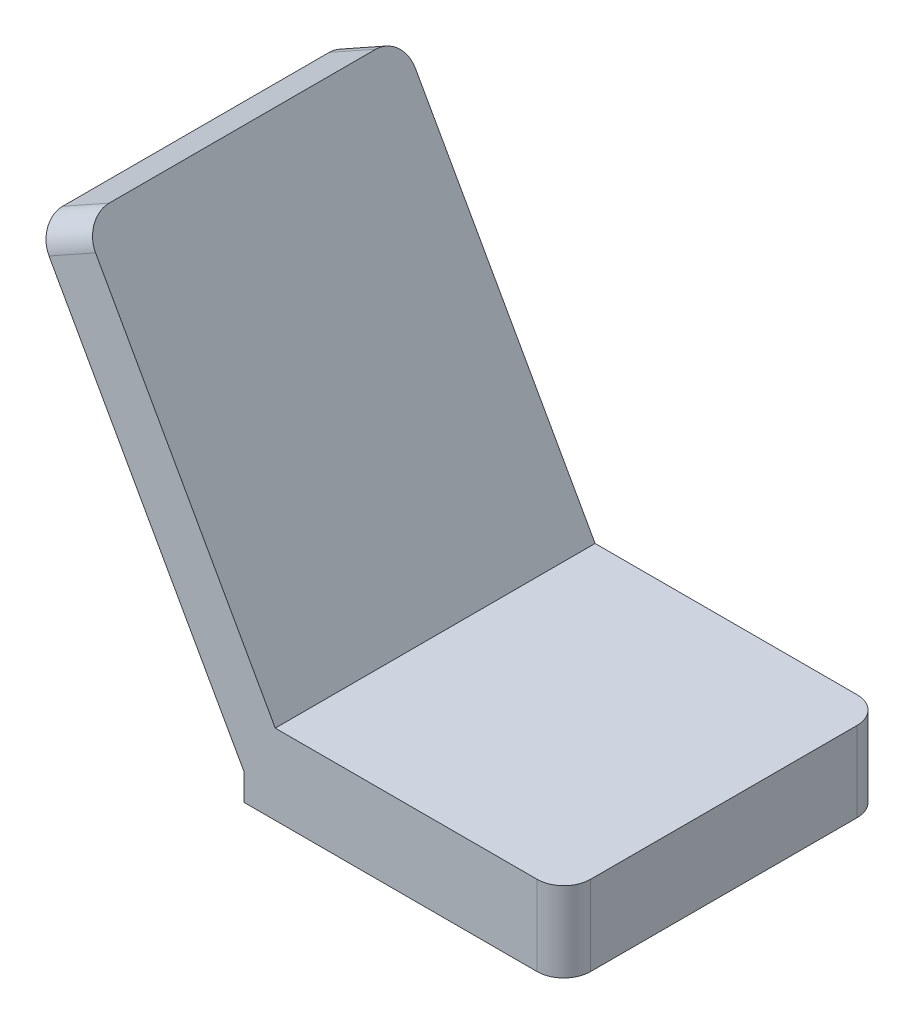
ISO-10303-21;
HEADER;
FILE_DESCRIPTION(('STEP AP214'),'2;1');
FILE_NAME('part.step','',(''),(''),'','','');
FILE_SCHEMA(('AUTOMOTIVE_DESIGN { 1 0 10303 214 1 1 1 1 }'));
ENDSEC;
DATA;
#1=APPLICATION_CONTEXT('core data for automotive mechanical design processes');
#2=APPLICATION_PROTOCOL_DEFINITION('international standard','automotive_design',2000,#1);
#3=PRODUCT_CONTEXT('',#1,'mechanical');
#4=PRODUCT('Part','Part','',(#3));
#5=PRODUCT_RELATED_PRODUCT_CATEGORY('part','',(#4));
#6=PRODUCT_DEFINITION_FORMATION('','',#4);
#7=PRODUCT_DEFINITION_CONTEXT('part definition',#1,'design');
#8=PRODUCT_DEFINITION('design','',#6,#7);
#9=PRODUCT_DEFINITION_SHAPE('','',#8);
#10=(LENGTH_UNIT() NAMED_UNIT(*) SI_UNIT(.MILLI.,.METRE.));
#11=(NAMED_UNIT(*) PLANE_ANGLE_UNIT() SI_UNIT($,.RADIAN.));
#12=(NAMED_UNIT(*) SI_UNIT($,.STERADIAN.) SOLID_ANGLE_UNIT());
#13=UNCERTAINTY_MEASURE_WITH_UNIT(LENGTH_MEASURE(1.E-05),#10,'distance_accuracy_value','');
#14=(GEOMETRIC_REPRESENTATION_CONTEXT(3) GLOBAL_UNCERTAINTY_ASSIGNED_CONTEXT((#13)) GLOBAL_UNIT_ASSIGNED_CONTEXT((#10,
#11,#12)) REPRESENTATION_CONTEXT('',''));
#15=CARTESIAN_POINT('',(0.,0.,0.));
#16=DIRECTION('',(0.,0.,1.));
#17=DIRECTION('',(1.,0.,0.));
#18=AXIS2_PLACEMENT_3D('',#15,#16,#17);
#19=CARTESIAN_POINT('',(-42.5966551147028,76.2512643083801,5.));
#20=DIRECTION('',(0.873013415052539,0.487696193483509,0.));
#21=DIRECTION('',(-0.487696193483509,0.873013415052539,0.));
#22=AXIS2_PLACEMENT_3D('',#19,#20,#21);
#23=CYLINDRICAL_SURFACE('',#22,5.);
#24=DIRECTION('',(0.873013415052539,0.487696193483509,0.));
#25=VECTOR('',#24,1.);
#26=CARTESIAN_POINT('',(-42.5966551147028,76.2512643083801,0.));
#27=LINE('',#26,#25);
#28=CARTESIAN_POINT('',(-61.885189794692,65.4760061289404,0.));
#29=VERTEX_POINT('',#28);
#30=CARTESIAN_POINT('',(-53.1550556441666,70.3529680637755,0.));
#31=VERTEX_POINT('',#30);
#32=EDGE_CURVE('E238',#29,#31,#27,.T.);
#33=ORIENTED_EDGE('',*,*,#32,.F.);
#34=CARTESIAN_POINT('',(-61.885189794692,65.4760061289404,5.));
#35=DIRECTION('',(-0.873013415052539,-0.487696193483508,0.));
#36=DIRECTION('',(0.487696193483508,-0.873013415052539,0.));
#37=AXIS2_PLACEMENT_3D('',#34,#35,#36);
#38=CIRCLE('',#37,5.);
#39=CARTESIAN_POINT('',(-64.3236707621096,69.8410732042031,5.));
#40=VERTEX_POINT('',#39);
#41=EDGE_CURVE('E53',#40,#29,#38,.T.);
#42=ORIENTED_EDGE('',*,*,#41,.F.);
#43=DIRECTION('',(0.873013415052539,0.487696193483509,0.));
#44=VECTOR('',#43,1.);
#45=CARTESIAN_POINT('',(-64.3236707621096,69.8410732042031,5.));
#46=LINE('',#45,#44);
#47=CARTESIAN_POINT('',(-55.5935366115842,74.7180351390382,5.));
#48=VERTEX_POINT('',#47);
#49=EDGE_CURVE('E242',#48,#40,#46,.F.);
#50=ORIENTED_EDGE('',*,*,#49,.F.);
#51=CARTESIAN_POINT('',(-53.1550556441666,70.3529680637755,5.));
#52=DIRECTION('',(-0.873013415052539,-0.487696193483508,0.));
#53=DIRECTION('',(0.487696193483508,-0.873013415052539,0.));
#54=AXIS2_PLACEMENT_3D('',#51,#52,#53);
#55=CIRCLE('',#54,5.);
#56=EDGE_CURVE('E11',#31,#48,#55,.F.);
#57=ORIENTED_EDGE('',*,*,#56,.F.);
#58=EDGE_LOOP('',(#33,#42,#50,#57));
#59=FACE_BOUND('',#58,.T.);
#60=ADVANCED_FACE('F45',(#59),#23,.T.);
#61=CARTESIAN_POINT('',(29.6920247165711,10.,5.));
#62=DIRECTION('',(0.,1.,0.));
#63=DIRECTION('',(0.,0.,1.));
#64=AXIS2_PLACEMENT_3D('',#61,#62,#63);
#65=CYLINDRICAL_SURFACE('',#64,5.);
#66=DIRECTION('',(0.,1.,0.));
#67=VECTOR('',#66,1.);
#68=CARTESIAN_POINT('',(34.6920247165711,10.,5.));
#69=LINE('',#68,#67);
#70=CARTESIAN_POINT('',(34.6920247165711,-5.,5.));
#71=VERTEX_POINT('',#70);
#72=CARTESIAN_POINT('',(34.6920247165711,10.,5.));
#73=VERTEX_POINT('',#72);
#74=EDGE_CURVE('E226',#71,#73,#69,.T.);
#75=ORIENTED_EDGE('',*,*,#74,.F.);
#76=CARTESIAN_POINT('',(29.6920247165711,-5.,5.));
#77=DIRECTION('',(0.,-1.,0.));
#78=DIRECTION('',(1.,0.,0.));
#79=AXIS2_PLACEMENT_3D('',#76,#77,#78);
#80=CIRCLE('',#79,5.);
#81=CARTESIAN_POINT('',(29.6920247165711,-5.,0.));
#82=VERTEX_POINT('',#81);
#83=EDGE_CURVE('E232',#82,#71,#80,.T.);
#84=ORIENTED_EDGE('',*,*,#83,.F.);
#85=DIRECTION('',(0.,1.,0.));
#86=VECTOR('',#85,1.);
#87=CARTESIAN_POINT('',(29.6920247165711,0.,0.));
#88=LINE('',#87,#86);
#89=CARTESIAN_POINT('',(29.6920247165711,10.,0.));
#90=VERTEX_POINT('',#89);
#91=EDGE_CURVE('E136',#90,#82,#88,.F.);
#92=ORIENTED_EDGE('',*,*,#91,.F.);
#93=CARTESIAN_POINT('',(29.6920247165711,10.,5.));
#94=DIRECTION('',(0.,-1.,0.));
#95=DIRECTION('',(1.,0.,0.));
#96=AXIS2_PLACEMENT_3D('',#93,#94,#95);
#97=CIRCLE('',#96,5.);
#98=EDGE_CURVE('E235',#73,#90,#97,.F.);
#99=ORIENTED_EDGE('',*,*,#98,.F.);
#100=EDGE_LOOP('',(#75,#84,#92,#99));
#101=FACE_BOUND('',#100,.T.);
#102=ADVANCED_FACE('F258',(#101),#65,.T.);
#103=CARTESIAN_POINT('',(29.6920247165711,0.,55.));
#104=DIRECTION('',(0.,-1.,0.));
#105=DIRECTION('',(0.,0.,-1.));
#106=AXIS2_PLACEMENT_3D('',#103,#104,#105);
#107=CYLINDRICAL_SURFACE('',#106,5.);
#108=DIRECTION('',(0.,1.,0.));
#109=VECTOR('',#108,1.);
#110=CARTESIAN_POINT('',(29.6920247165711,0.,60.));
#111=LINE('',#110,#109);
#112=CARTESIAN_POINT('',(29.6920247165711,-5.,60.));
#113=VERTEX_POINT('',#112);
#114=CARTESIAN_POINT('',(29.6920247165711,10.,60.));
#115=VERTEX_POINT('',#114);
#116=EDGE_CURVE('E212',#113,#115,#111,.T.);
#117=ORIENTED_EDGE('',*,*,#116,.F.);
#118=CARTESIAN_POINT('',(29.6920247165711,-5.,55.));
#119=DIRECTION('',(0.,-1.,0.));
#120=DIRECTION('',(1.,0.,0.));
#121=AXIS2_PLACEMENT_3D('',#118,#119,#120);
#122=CIRCLE('',#121,5.);
#123=CARTESIAN_POINT('',(34.6920247165711,-5.,55.));
#124=VERTEX_POINT('',#123);
#125=EDGE_CURVE('E220',#124,#113,#122,.T.);
#126=ORIENTED_EDGE('',*,*,#125,.F.);
#127=DIRECTION('',(0.,1.,0.));
#128=VECTOR('',#127,1.);
#129=CARTESIAN_POINT('',(34.6920247165711,0.,55.));
#130=LINE('',#129,#128);
#131=CARTESIAN_POINT('',(34.6920247165711,10.,55.));
#132=VERTEX_POINT('',#131);
#133=EDGE_CURVE('E216',#132,#124,#130,.F.);
#134=ORIENTED_EDGE('',*,*,#133,.F.);
#135=CARTESIAN_POINT('',(29.6920247165711,10.,55.));
#136=DIRECTION('',(0.,-1.,0.));
#137=DIRECTION('',(1.,0.,0.));
#138=AXIS2_PLACEMENT_3D('',#135,#136,#137);
#139=CIRCLE('',#138,5.);
#140=EDGE_CURVE('E223',#115,#132,#139,.F.);
#141=ORIENTED_EDGE('',*,*,#140,.F.);
#142=EDGE_LOOP('',(#117,#126,#134,#141));
#143=FACE_BOUND('',#142,.T.);
#144=ADVANCED_FACE('F267',(#143),#107,.T.);
#145=CARTESIAN_POINT('',(-42.5966551147028,76.2512643083801,55.));
#146=DIRECTION('',(0.873013415052539,0.487696193483509,0.));
#147=DIRECTION('',(-0.487696193483509,0.873013415052539,0.));
#148=AXIS2_PLACEMENT_3D('',#145,#146,#147);
#149=CYLINDRICAL_SURFACE('',#148,5.);
#150=DIRECTION('',(-0.873013415052539,-0.487696193483509,0.));
#151=VECTOR('',#150,1.);
#152=CARTESIAN_POINT('',(-42.5966551147028,76.2512643083801,60.));
#153=LINE('',#152,#151);
#154=CARTESIAN_POINT('',(-53.1550556441666,70.3529680637755,60.));
#155=VERTEX_POINT('',#154);
#156=CARTESIAN_POINT('',(-61.885189794692,65.4760061289404,60.));
#157=VERTEX_POINT('',#156);
#158=EDGE_CURVE('E198',#155,#157,#153,.T.);
#159=ORIENTED_EDGE('',*,*,#158,.F.);
#160=CARTESIAN_POINT('',(-53.1550556441666,70.3529680637755,55.));
#161=DIRECTION('',(-0.873013415052539,-0.487696193483508,0.));
#162=DIRECTION('',(0.487696193483508,-0.873013415052539,0.));
#163=AXIS2_PLACEMENT_3D('',#160,#161,#162);
#164=CIRCLE('',#163,5.);
#165=CARTESIAN_POINT('',(-55.5935366115842,74.7180351390382,55.));
#166=VERTEX_POINT('',#165);
#167=EDGE_CURVE('E206',#166,#155,#164,.F.);
#168=ORIENTED_EDGE('',*,*,#167,.F.);
#169=DIRECTION('',(-0.873013415052539,-0.487696193483509,0.));
#170=VECTOR('',#169,1.);
#171=CARTESIAN_POINT('',(-45.0351360821203,80.6163313836428,55.));
#172=LINE('',#171,#170);
#173=CARTESIAN_POINT('',(-64.3236707621096,69.8410732042031,55.));
#174=VERTEX_POINT('',#173);
#175=EDGE_CURVE('E202',#174,#166,#172,.F.);
#176=ORIENTED_EDGE('',*,*,#175,.F.);
#177=CARTESIAN_POINT('',(-61.885189794692,65.4760061289404,55.));
#178=DIRECTION('',(-0.873013415052539,-0.487696193483508,0.));
#179=DIRECTION('',(0.487696193483508,-0.873013415052539,0.));
#180=AXIS2_PLACEMENT_3D('',#177,#178,#179);
#181=CIRCLE('',#180,5.);
#182=EDGE_CURVE('E209',#157,#174,#181,.T.);
#183=ORIENTED_EDGE('',*,*,#182,.F.);
#184=EDGE_LOOP('',(#159,#168,#176,#183));
#185=FACE_BOUND('',#184,.T.);
#186=ADVANCED_FACE('F286',(#185),#149,.T.);
#187=CARTESIAN_POINT('',(-16.5778411329035,4.87696193483508,60.));
#188=DIRECTION('',(-0.873013415052539,-0.487696193483508,0.));
#189=DIRECTION('',(0.487696193483508,-0.873013415052539,0.));
#190=AXIS2_PLACEMENT_3D('',#187,#188,#189);
#191=PLANE('',#190);
#192=DIRECTION('',(-0.487696193483508,0.873013415052539,0.));
#193=VECTOR('',#192,1.);
#194=CARTESIAN_POINT('',(-16.5778411329035,4.87696193483508,0.));
#195=LINE('',#194,#193);
#196=CARTESIAN_POINT('',(-19.4397515232515,10.,0.));
#197=VERTEX_POINT('',#196);
#198=EDGE_CURVE('E154',#197,#31,#195,.T.);
#199=ORIENTED_EDGE('',*,*,#198,.T.);
#200=ORIENTED_EDGE('',*,*,#56,.T.);
#201=DIRECTION('',(0.,0.,-1.));
#202=VECTOR('',#201,1.);
#203=CARTESIAN_POINT('',(-55.5935366115842,74.7180351390382,60.));
#204=LINE('',#203,#202);
#205=EDGE_CURVE('E194',#166,#48,#204,.T.);
#206=ORIENTED_EDGE('',*,*,#205,.F.);
#207=ORIENTED_EDGE('',*,*,#167,.T.);
#208=DIRECTION('',(-0.487696193483508,0.873013415052539,0.));
#209=VECTOR('',#208,1.);
#210=CARTESIAN_POINT('',(-16.5778411329035,4.87696193483508,60.));
#211=LINE('',#210,#209);
#212=CARTESIAN_POINT('',(-19.4397515232515,10.,60.));
#213=VERTEX_POINT('',#212);
#214=EDGE_CURVE('E164',#213,#155,#211,.T.);
#215=ORIENTED_EDGE('',*,*,#214,.F.);
#216=DIRECTION('',(0.,0.,-1.));
#217=VECTOR('',#216,1.);
#218=CARTESIAN_POINT('',(-19.4397515232515,10.,60.));
#219=LINE('',#218,#217);
#220=EDGE_CURVE('E175',#213,#197,#219,.T.);
#221=ORIENTED_EDGE('',*,*,#220,.T.);
#222=EDGE_LOOP('',(#199,#200,#206,#207,#215,#221));
#223=FACE_BOUND('',#222,.T.);
#224=ADVANCED_FACE('F249',(#223),#191,.F.);
#225=CARTESIAN_POINT('',(-64.3236707621096,69.8410732042031,60.));
#226=DIRECTION('',(-0.487696193483509,0.873013415052539,0.));
#227=DIRECTION('',(-0.873013415052539,-0.487696193483509,0.));
#228=AXIS2_PLACEMENT_3D('',#225,#226,#227);
#229=PLANE('',#228);
#230=ORIENTED_EDGE('',*,*,#205,.T.);
#231=ORIENTED_EDGE('',*,*,#49,.T.);
#232=DIRECTION('',(0.,0.,-1.));
#233=VECTOR('',#232,1.);
#234=CARTESIAN_POINT('',(-64.3236707621096,69.8410732042031,60.));
#235=LINE('',#234,#233);
#236=EDGE_CURVE('E190',#174,#40,#235,.T.);
#237=ORIENTED_EDGE('',*,*,#236,.F.);
#238=ORIENTED_EDGE('',*,*,#175,.T.);
#239=EDGE_LOOP('',(#230,#231,#237,#238));
#240=FACE_BOUND('',#239,.T.);
#241=ADVANCED_FACE('F277',(#240),#229,.T.);
#242=CARTESIAN_POINT('',(-25.3079752834289,0.,60.));
#243=DIRECTION('',(-0.873013415052539,-0.487696193483508,0.));
#244=DIRECTION('',(0.487696193483508,-0.873013415052539,0.));
#245=AXIS2_PLACEMENT_3D('',#242,#243,#244);
#246=PLANE('',#245);
#247=ORIENTED_EDGE('',*,*,#236,.T.);
#248=ORIENTED_EDGE('',*,*,#41,.T.);
#249=DIRECTION('',(-0.487696193483508,0.873013415052539,0.));
#250=VECTOR('',#249,1.);
#251=CARTESIAN_POINT('',(-25.3079752834289,0.,0.));
#252=LINE('',#251,#250);
#253=CARTESIAN_POINT('',(-25.3079752834289,0.,0.));
#254=VERTEX_POINT('',#253);
#255=EDGE_CURVE('E159',#254,#29,#252,.T.);
#256=ORIENTED_EDGE('',*,*,#255,.F.);
#257=DIRECTION('',(0.,0.,-1.));
#258=VECTOR('',#257,1.);
#259=CARTESIAN_POINT('',(-25.3079752834289,0.,60.));
#260=LINE('',#259,#258);
#261=CARTESIAN_POINT('',(-25.3079752834289,0.,60.));
#262=VERTEX_POINT('',#261);
#263=EDGE_CURVE('E152',#262,#254,#260,.T.);
#264=ORIENTED_EDGE('',*,*,#263,.F.);
#265=DIRECTION('',(-0.487696193483508,0.873013415052539,0.));
#266=VECTOR('',#265,1.);
#267=CARTESIAN_POINT('',(-25.3079752834289,0.,60.));
#268=LINE('',#267,#266);
#269=EDGE_CURVE('E168',#262,#157,#268,.T.);
#270=ORIENTED_EDGE('',*,*,#269,.T.);
#271=ORIENTED_EDGE('',*,*,#182,.T.);
#272=EDGE_LOOP('',(#247,#248,#256,#264,#270,#271));
#273=FACE_BOUND('',#272,.T.);
#274=ADVANCED_FACE('F246',(#273),#246,.T.);
#275=CARTESIAN_POINT('',(34.6920247165711,10.,60.));
#276=DIRECTION('',(1.,0.,0.));
#277=DIRECTION('',(0.,0.,-1.));
#278=AXIS2_PLACEMENT_3D('',#275,#276,#277);
#279=PLANE('',#278);
#280=DIRECTION('',(0.,0.,1.));
#281=VECTOR('',#280,1.);
#282=CARTESIAN_POINT('',(34.6920247165711,-5.,60.));
#283=LINE('',#282,#281);
#284=EDGE_CURVE('E139',#71,#124,#283,.T.);
#285=ORIENTED_EDGE('',*,*,#284,.F.);
#286=ORIENTED_EDGE('',*,*,#74,.T.);
#287=DIRECTION('',(0.,0.,-1.));
#288=VECTOR('',#287,1.);
#289=CARTESIAN_POINT('',(34.6920247165711,10.,60.));
#290=LINE('',#289,#288);
#291=EDGE_CURVE('E184',#132,#73,#290,.T.);
#292=ORIENTED_EDGE('',*,*,#291,.F.);
#293=ORIENTED_EDGE('',*,*,#133,.T.);
#294=EDGE_LOOP('',(#285,#286,#292,#293));
#295=FACE_BOUND('',#294,.T.);
#296=ADVANCED_FACE('F268',(#295),#279,.T.);
#297=CARTESIAN_POINT('',(34.6920247165711,10.,60.));
#298=DIRECTION('',(0.,-1.,0.));
#299=DIRECTION('',(1.,0.,0.));
#300=AXIS2_PLACEMENT_3D('',#297,#298,#299);
#301=PLANE('',#300);
#302=ORIENTED_EDGE('',*,*,#291,.T.);
#303=ORIENTED_EDGE('',*,*,#98,.T.);
#304=DIRECTION('',(-1.,0.,0.));
#305=VECTOR('',#304,1.);
#306=CARTESIAN_POINT('',(34.6920247165711,10.,0.));
#307=LINE('',#306,#305);
#308=EDGE_CURVE('E169',#90,#197,#307,.T.);
#309=ORIENTED_EDGE('',*,*,#308,.T.);
#310=ORIENTED_EDGE('',*,*,#220,.F.);
#311=DIRECTION('',(-1.,0.,0.));
#312=VECTOR('',#311,1.);
#313=CARTESIAN_POINT('',(34.6920247165711,10.,60.));
#314=LINE('',#313,#312);
#315=EDGE_CURVE('E173',#115,#213,#314,.T.);
#316=ORIENTED_EDGE('',*,*,#315,.F.);
#317=ORIENTED_EDGE('',*,*,#140,.T.);
#318=EDGE_LOOP('',(#302,#303,#309,#310,#316,#317));
#319=FACE_BOUND('',#318,.T.);
#320=ADVANCED_FACE('F254',(#319),#301,.F.);
#321=CARTESIAN_POINT('',(0.,0.,60.));
#322=DIRECTION('',(0.,0.,-1.));
#323=DIRECTION('',(-1.,0.,0.));
#324=AXIS2_PLACEMENT_3D('',#321,#322,#323);
#325=PLANE('',#324);
#326=DIRECTION('',(-1.,0.,0.));
#327=VECTOR('',#326,1.);
#328=CARTESIAN_POINT('',(-25.3079752834289,-5.,60.));
#329=LINE('',#328,#327);
#330=CARTESIAN_POINT('',(-25.3079752834289,-5.,60.));
#331=VERTEX_POINT('',#330);
#332=EDGE_CURVE('E145',#113,#331,#329,.T.);
#333=ORIENTED_EDGE('',*,*,#332,.F.);
#334=ORIENTED_EDGE('',*,*,#116,.T.);
#335=ORIENTED_EDGE('',*,*,#315,.T.);
#336=ORIENTED_EDGE('',*,*,#214,.T.);
#337=ORIENTED_EDGE('',*,*,#158,.T.);
#338=ORIENTED_EDGE('',*,*,#269,.F.);
#339=DIRECTION('',(0.,1.,0.));
#340=VECTOR('',#339,1.);
#341=CARTESIAN_POINT('',(-25.3079752834289,-5.,60.));
#342=LINE('',#341,#340);
#343=EDGE_CURVE('E155',#331,#262,#342,.T.);
#344=ORIENTED_EDGE('',*,*,#343,.F.);
#345=EDGE_LOOP('',(#333,#334,#335,#336,#337,#338,#344));
#346=FACE_BOUND('',#345,.T.);
#347=ADVANCED_FACE('F275',(#346),#325,.F.);
#348=CARTESIAN_POINT('',(0.,0.,0.));
#349=DIRECTION('',(0.,0.,-1.));
#350=DIRECTION('',(-1.,0.,0.));
#351=AXIS2_PLACEMENT_3D('',#348,#349,#350);
#352=PLANE('',#351);
#353=ORIENTED_EDGE('',*,*,#255,.T.);
#354=ORIENTED_EDGE('',*,*,#32,.T.);
#355=ORIENTED_EDGE('',*,*,#198,.F.);
#356=ORIENTED_EDGE('',*,*,#308,.F.);
#357=ORIENTED_EDGE('',*,*,#91,.T.);
#358=DIRECTION('',(1.,0.,0.));
#359=VECTOR('',#358,1.);
#360=CARTESIAN_POINT('',(-25.3079752834289,-5.,0.));
#361=LINE('',#360,#359);
#362=CARTESIAN_POINT('',(-25.3079752834289,-5.,0.));
#363=VERTEX_POINT('',#362);
#364=EDGE_CURVE('E127',#363,#82,#361,.T.);
#365=ORIENTED_EDGE('',*,*,#364,.F.);
#366=DIRECTION('',(0.,1.,0.));
#367=VECTOR('',#366,1.);
#368=CARTESIAN_POINT('',(-25.3079752834289,-5.,0.));
#369=LINE('',#368,#367);
#370=EDGE_CURVE('E132',#363,#254,#369,.T.);
#371=ORIENTED_EDGE('',*,*,#370,.T.);
#372=EDGE_LOOP('',(#353,#354,#355,#356,#357,#365,#371));
#373=FACE_BOUND('',#372,.T.);
#374=ADVANCED_FACE('F130',(#373),#352,.T.);
#375=CARTESIAN_POINT('',(-25.3079752834289,-5.,60.));
#376=DIRECTION('',(1.,0.,0.));
#377=DIRECTION('',(0.,1.,0.));
#378=AXIS2_PLACEMENT_3D('',#375,#376,#377);
#379=PLANE('',#378);
#380=ORIENTED_EDGE('',*,*,#263,.T.);
#381=ORIENTED_EDGE('',*,*,#370,.F.);
#382=DIRECTION('',(0.,0.,-1.));
#383=VECTOR('',#382,1.);
#384=CARTESIAN_POINT('',(-25.3079752834289,-5.,60.));
#385=LINE('',#384,#383);
#386=EDGE_CURVE('E140',#331,#363,#385,.T.);
#387=ORIENTED_EDGE('',*,*,#386,.F.);
#388=ORIENTED_EDGE('',*,*,#343,.T.);
#389=EDGE_LOOP('',(#380,#381,#387,#388));
#390=FACE_BOUND('',#389,.T.);
#391=ADVANCED_FACE('F151',(#390),#379,.F.);
#392=CARTESIAN_POINT('',(0.,-5.,0.));
#393=DIRECTION('',(0.,-1.,0.));
#394=DIRECTION('',(1.,0.,0.));
#395=AXIS2_PLACEMENT_3D('',#392,#393,#394);
#396=PLANE('',#395);
#397=ORIENTED_EDGE('',*,*,#364,.T.);
#398=ORIENTED_EDGE('',*,*,#83,.T.);
#399=ORIENTED_EDGE('',*,*,#284,.T.);
#400=ORIENTED_EDGE('',*,*,#125,.T.);
#401=ORIENTED_EDGE('',*,*,#332,.T.);
#402=ORIENTED_EDGE('',*,*,#386,.T.);
#403=EDGE_LOOP('',(#397,#398,#399,#400,#401,#402));
#404=FACE_BOUND('',#403,.T.);
#405=ADVANCED_FACE('F143',(#404),#396,.T.);
#406=CLOSED_SHELL('',(#60,#102,#144,#186,#224,#241,#274,#296,#320,#347,#374,#391,#405));
#407=MANIFOLD_SOLID_BREP('B2',#406);
#408=ADVANCED_BREP_SHAPE_REPRESENTATION('',(#18,#407),#14);
#409=SHAPE_DEFINITION_REPRESENTATION(#9,#408);
ENDSEC;
END-ISO-10303-21;
